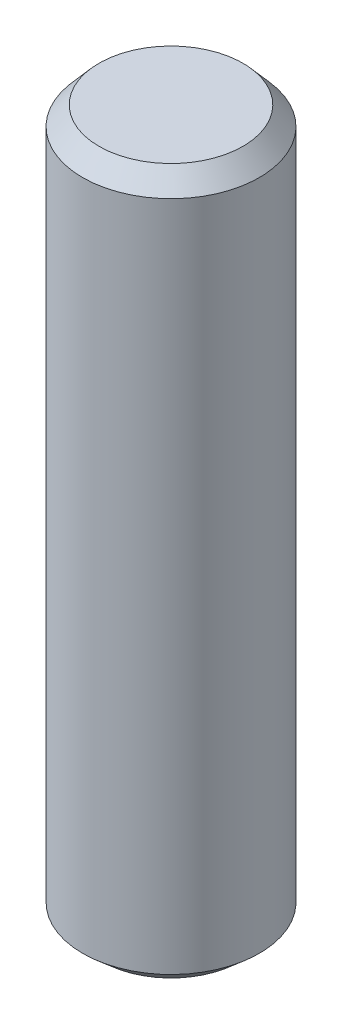
ISO-10303-21;
HEADER;
FILE_DESCRIPTION(('STEP AP214'),'2;1');
FILE_NAME('part.step','',(''),(''),'','','');
FILE_SCHEMA(('AUTOMOTIVE_DESIGN { 1 0 10303 214 1 1 1 1 }'));
ENDSEC;
DATA;
#1=APPLICATION_CONTEXT('core data for automotive mechanical design processes');
#2=APPLICATION_PROTOCOL_DEFINITION('international standard','automotive_design',2000,#1);
#3=PRODUCT_CONTEXT('',#1,'mechanical');
#4=PRODUCT('Part','Part','',(#3));
#5=PRODUCT_RELATED_PRODUCT_CATEGORY('part','',(#4));
#6=PRODUCT_DEFINITION_FORMATION('','',#4);
#7=PRODUCT_DEFINITION_CONTEXT('part definition',#1,'design');
#8=PRODUCT_DEFINITION('design','',#6,#7);
#9=PRODUCT_DEFINITION_SHAPE('','',#8);
#10=(LENGTH_UNIT() NAMED_UNIT(*) SI_UNIT(.MILLI.,.METRE.));
#11=(NAMED_UNIT(*) PLANE_ANGLE_UNIT() SI_UNIT($,.RADIAN.));
#12=(NAMED_UNIT(*) SI_UNIT($,.STERADIAN.) SOLID_ANGLE_UNIT());
#13=UNCERTAINTY_MEASURE_WITH_UNIT(LENGTH_MEASURE(1.E-05),#10,'distance_accuracy_value','');
#14=(GEOMETRIC_REPRESENTATION_CONTEXT(3) GLOBAL_UNCERTAINTY_ASSIGNED_CONTEXT((#13)) GLOBAL_UNIT_ASSIGNED_CONTEXT((#10,
#11,#12)) REPRESENTATION_CONTEXT('',''));
#15=CARTESIAN_POINT('',(0.,0.,0.));
#16=DIRECTION('',(0.,0.,1.));
#17=DIRECTION('',(1.,0.,0.));
#18=AXIS2_PLACEMENT_3D('',#15,#16,#17);
#19=CARTESIAN_POINT('',(0.,19.05,0.));
#20=DIRECTION('',(0.,-1.,0.));
#21=DIRECTION('',(0.,0.,-1.));
#22=AXIS2_PLACEMENT_3D('',#19,#20,#21);
#23=CYLINDRICAL_SURFACE('',#22,4.7625);
#24=CARTESIAN_POINT('',(0.,-18.1668046743787,0.));
#25=DIRECTION('',(0.,1.,0.));
#26=DIRECTION('',(0.,0.,1.));
#27=AXIS2_PLACEMENT_3D('',#24,#25,#26);
#28=CIRCLE('',#27,4.7625);
#29=CARTESIAN_POINT('',(0.,-18.1668046743787,4.7625));
#30=VERTEX_POINT('',#29);
#31=EDGE_CURVE('E43',#30,#30,#28,.T.);
#32=ORIENTED_EDGE('',*,*,#31,.T.);
#33=EDGE_LOOP('',(#32));
#34=FACE_BOUND('',#33,.T.);
#35=CARTESIAN_POINT('',(0.,18.034,0.));
#36=DIRECTION('',(0.,1.,0.));
#37=DIRECTION('',(0.,0.,1.));
#38=AXIS2_PLACEMENT_3D('',#35,#36,#37);
#39=CIRCLE('',#38,4.7625);
#40=CARTESIAN_POINT('',(0.,18.034,4.7625));
#41=VERTEX_POINT('',#40);
#42=EDGE_CURVE('E47',#41,#41,#39,.F.);
#43=ORIENTED_EDGE('',*,*,#42,.T.);
#44=EDGE_LOOP('',(#43));
#45=FACE_BOUND('',#44,.T.);
#46=ADVANCED_FACE('F32',(#34,#45),#23,.T.);
#47=CARTESIAN_POINT('',(0.,19.05,0.));
#48=DIRECTION('',(0.,1.,0.));
#49=DIRECTION('',(0.,0.,1.));
#50=AXIS2_PLACEMENT_3D('',#47,#48,#49);
#51=PLANE('',#50);
#52=CARTESIAN_POINT('',(0.,19.05,0.));
#53=DIRECTION('',(0.,1.,0.));
#54=DIRECTION('',(0.,0.,1.));
#55=AXIS2_PLACEMENT_3D('',#52,#53,#54);
#56=CIRCLE('',#55,3.87930467437875);
#57=CARTESIAN_POINT('',(0.,19.05,3.87930467437875));
#58=VERTEX_POINT('',#57);
#59=EDGE_CURVE('E10',#58,#58,#56,.T.);
#60=ORIENTED_EDGE('',*,*,#59,.T.);
#61=EDGE_LOOP('',(#60));
#62=FACE_BOUND('',#61,.T.);
#63=ADVANCED_FACE('F63',(#62),#51,.T.);
#64=CARTESIAN_POINT('',(0.,-19.05,0.));
#65=DIRECTION('',(0.,1.,0.));
#66=DIRECTION('',(0.,0.,1.));
#67=AXIS2_PLACEMENT_3D('',#64,#65,#66);
#68=PLANE('',#67);
#69=CARTESIAN_POINT('',(0.,-19.05,0.));
#70=DIRECTION('',(0.,1.,0.));
#71=DIRECTION('',(0.,0.,1.));
#72=AXIS2_PLACEMENT_3D('',#69,#70,#71);
#73=CIRCLE('',#72,3.74649999999997);
#74=CARTESIAN_POINT('',(0.,-19.05,3.74649999999997));
#75=VERTEX_POINT('',#74);
#76=EDGE_CURVE('E39',#75,#75,#73,.F.);
#77=ORIENTED_EDGE('',*,*,#76,.T.);
#78=EDGE_LOOP('',(#77));
#79=FACE_BOUND('',#78,.T.);
#80=ADVANCED_FACE('F60',(#79),#68,.F.);
#81=CARTESIAN_POINT('',(0.,-18.1668046743787,0.));
#82=DIRECTION('',(0.,1.,0.));
#83=DIRECTION('',(0.,0.,1.));
#84=AXIS2_PLACEMENT_3D('',#81,#82,#83);
#85=CONICAL_SURFACE('',#84,4.7625,0.855211333477226);
#86=ORIENTED_EDGE('',*,*,#76,.F.);
#87=EDGE_LOOP('',(#86));
#88=FACE_BOUND('',#87,.T.);
#89=ORIENTED_EDGE('',*,*,#31,.F.);
#90=EDGE_LOOP('',(#89));
#91=FACE_BOUND('',#90,.T.);
#92=ADVANCED_FACE('F56',(#88,#91),#85,.T.);
#93=CARTESIAN_POINT('',(0.,19.05,0.));
#94=DIRECTION('',(0.,-1.,0.));
#95=DIRECTION('',(0.,0.,-1.));
#96=AXIS2_PLACEMENT_3D('',#93,#94,#95);
#97=CONICAL_SURFACE('',#96,3.87930467437875,0.715584993317674);
#98=ORIENTED_EDGE('',*,*,#42,.F.);
#99=EDGE_LOOP('',(#98));
#100=FACE_BOUND('',#99,.T.);
#101=ORIENTED_EDGE('',*,*,#59,.F.);
#102=EDGE_LOOP('',(#101));
#103=FACE_BOUND('',#102,.T.);
#104=ADVANCED_FACE('F34',(#100,#103),#97,.T.);
#105=CLOSED_SHELL('',(#46,#63,#80,#92,#104));
#106=MANIFOLD_SOLID_BREP('B2',#105);
#107=ADVANCED_BREP_SHAPE_REPRESENTATION('',(#18,#106),#14);
#108=SHAPE_DEFINITION_REPRESENTATION(#9,#107);
ENDSEC;
END-ISO-10303-21;
